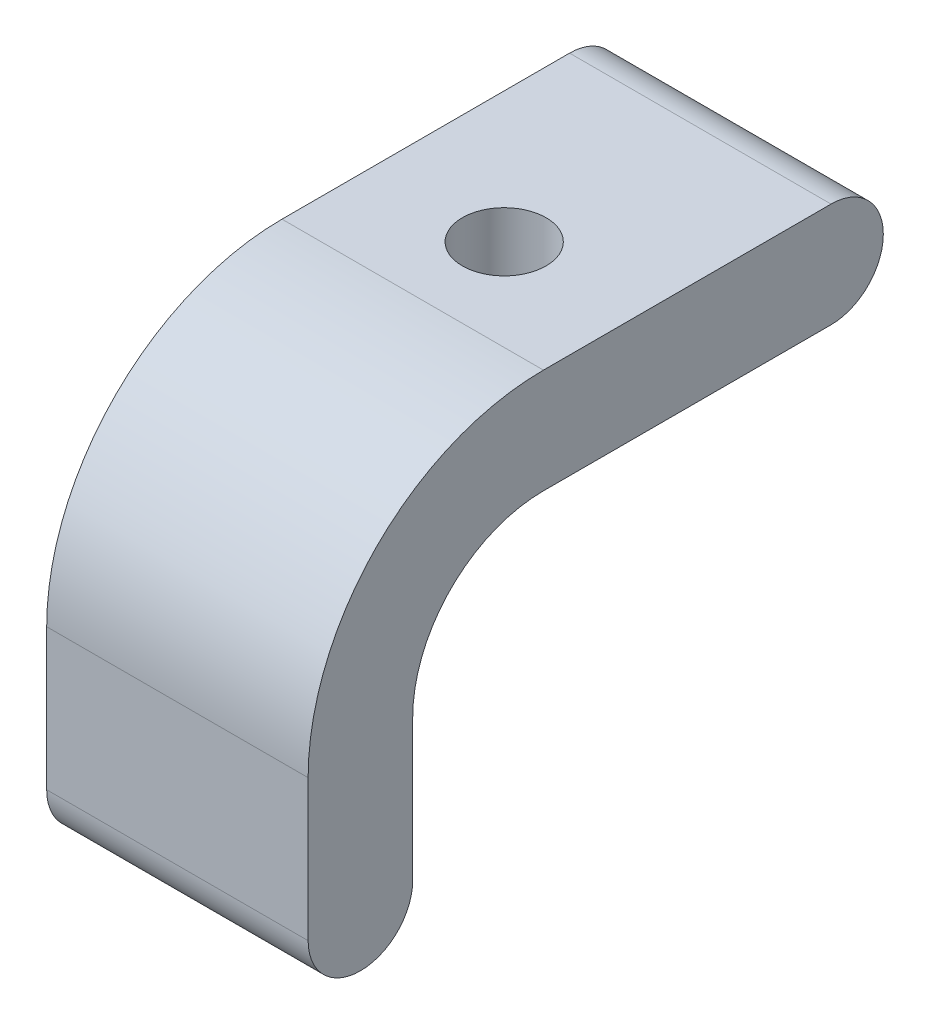
ISO-10303-21;
HEADER;
FILE_DESCRIPTION(('STEP AP214'),'2;1');
FILE_NAME('part.step','',(''),(''),'','','');
FILE_SCHEMA(('AUTOMOTIVE_DESIGN { 1 0 10303 214 1 1 1 1 }'));
ENDSEC;
DATA;
#1=APPLICATION_CONTEXT('core data for automotive mechanical design processes');
#2=APPLICATION_PROTOCOL_DEFINITION('international standard','automotive_design',2000,#1);
#3=PRODUCT_CONTEXT('',#1,'mechanical');
#4=PRODUCT('Part','Part','',(#3));
#5=PRODUCT_RELATED_PRODUCT_CATEGORY('part','',(#4));
#6=PRODUCT_DEFINITION_FORMATION('','',#4);
#7=PRODUCT_DEFINITION_CONTEXT('part definition',#1,'design');
#8=PRODUCT_DEFINITION('design','',#6,#7);
#9=PRODUCT_DEFINITION_SHAPE('','',#8);
#10=(LENGTH_UNIT() NAMED_UNIT(*) SI_UNIT(.MILLI.,.METRE.));
#11=(NAMED_UNIT(*) PLANE_ANGLE_UNIT() SI_UNIT($,.RADIAN.));
#12=(NAMED_UNIT(*) SI_UNIT($,.STERADIAN.) SOLID_ANGLE_UNIT());
#13=UNCERTAINTY_MEASURE_WITH_UNIT(LENGTH_MEASURE(1.E-05),#10,'distance_accuracy_value','');
#14=(GEOMETRIC_REPRESENTATION_CONTEXT(3) GLOBAL_UNCERTAINTY_ASSIGNED_CONTEXT((#13)) GLOBAL_UNIT_ASSIGNED_CONTEXT((#10,
#11,#12)) REPRESENTATION_CONTEXT('',''));
#15=CARTESIAN_POINT('',(0.,0.,0.));
#16=DIRECTION('',(0.,0.,1.));
#17=DIRECTION('',(1.,0.,0.));
#18=AXIS2_PLACEMENT_3D('',#15,#16,#17);
#19=CARTESIAN_POINT('',(10.,-4.99999999999999,0.));
#20=DIRECTION('',(-1.,0.,0.));
#21=DIRECTION('',(0.,0.,1.));
#22=AXIS2_PLACEMENT_3D('',#19,#20,#21);
#23=CYLINDRICAL_SURFACE('',#22,5.);
#24=CARTESIAN_POINT('',(0.,-4.99999999999999,0.));
#25=DIRECTION('',(-1.,0.,0.));
#26=DIRECTION('',(0.,0.,-1.));
#27=AXIS2_PLACEMENT_3D('',#24,#25,#26);
#28=CIRCLE('',#27,5.);
#29=CARTESIAN_POINT('',(0.,-4.99999999999999,5.));
#30=VERTEX_POINT('',#29);
#31=CARTESIAN_POINT('',(0.,0.,0.));
#32=VERTEX_POINT('',#31);
#33=EDGE_CURVE('E132',#30,#32,#28,.T.);
#34=ORIENTED_EDGE('',*,*,#33,.T.);
#35=DIRECTION('',(-1.,0.,0.));
#36=VECTOR('',#35,1.);
#37=CARTESIAN_POINT('',(10.,0.,0.));
#38=LINE('',#37,#36);
#39=CARTESIAN_POINT('',(10.,0.,0.));
#40=VERTEX_POINT('',#39);
#41=EDGE_CURVE('E11',#40,#32,#38,.T.);
#42=ORIENTED_EDGE('',*,*,#41,.F.);
#43=CARTESIAN_POINT('',(10.,-4.99999999999999,0.));
#44=DIRECTION('',(-1.,0.,0.));
#45=DIRECTION('',(0.,0.,-1.));
#46=AXIS2_PLACEMENT_3D('',#43,#44,#45);
#47=CIRCLE('',#46,5.);
#48=CARTESIAN_POINT('',(10.,-4.99999999999999,5.));
#49=VERTEX_POINT('',#48);
#50=EDGE_CURVE('E147',#49,#40,#47,.T.);
#51=ORIENTED_EDGE('',*,*,#50,.F.);
#52=DIRECTION('',(-1.,0.,0.));
#53=VECTOR('',#52,1.);
#54=CARTESIAN_POINT('',(10.,-4.99999999999999,5.));
#55=LINE('',#54,#53);
#56=EDGE_CURVE('E128',#49,#30,#55,.T.);
#57=ORIENTED_EDGE('',*,*,#56,.T.);
#58=EDGE_LOOP('',(#34,#42,#51,#57));
#59=FACE_BOUND('',#58,.T.);
#60=ADVANCED_FACE('F36',(#59),#23,.F.);
#61=CARTESIAN_POINT('',(10.,0.,0.));
#62=DIRECTION('',(0.,1.,0.));
#63=DIRECTION('',(0.,0.,1.));
#64=AXIS2_PLACEMENT_3D('',#61,#62,#63);
#65=PLANE('',#64);
#66=CARTESIAN_POINT('',(5.,0.,-3.5));
#67=DIRECTION('',(0.,1.,0.));
#68=DIRECTION('',(0.,0.,1.));
#69=AXIS2_PLACEMENT_3D('',#66,#67,#68);
#70=CIRCLE('',#69,1.6);
#71=CARTESIAN_POINT('',(5.,0.,-1.9));
#72=VERTEX_POINT('',#71);
#73=EDGE_CURVE('E136',#72,#72,#70,.T.);
#74=ORIENTED_EDGE('',*,*,#73,.T.);
#75=EDGE_LOOP('',(#74));
#76=FACE_BOUND('',#75,.T.);
#77=DIRECTION('',(0.,0.,-1.));
#78=VECTOR('',#77,1.);
#79=CARTESIAN_POINT('',(0.,0.,0.));
#80=LINE('',#79,#78);
#81=CARTESIAN_POINT('',(0.,0.,-11.));
#82=VERTEX_POINT('',#81);
#83=EDGE_CURVE('E135',#32,#82,#80,.T.);
#84=ORIENTED_EDGE('',*,*,#83,.T.);
#85=DIRECTION('',(-1.,0.,0.));
#86=VECTOR('',#85,1.);
#87=CARTESIAN_POINT('',(10.,0.,-11.));
#88=LINE('',#87,#86);
#89=CARTESIAN_POINT('',(10.,0.,-11.));
#90=VERTEX_POINT('',#89);
#91=EDGE_CURVE('E44',#90,#82,#88,.T.);
#92=ORIENTED_EDGE('',*,*,#91,.F.);
#93=DIRECTION('',(0.,0.,-1.));
#94=VECTOR('',#93,1.);
#95=CARTESIAN_POINT('',(10.,0.,0.));
#96=LINE('',#95,#94);
#97=EDGE_CURVE('E95',#40,#90,#96,.T.);
#98=ORIENTED_EDGE('',*,*,#97,.F.);
#99=ORIENTED_EDGE('',*,*,#41,.T.);
#100=EDGE_LOOP('',(#84,#92,#98,#99));
#101=FACE_BOUND('',#100,.T.);
#102=ADVANCED_FACE('F196',(#76,#101),#65,.F.);
#103=CARTESIAN_POINT('',(10.,2.,-11.));
#104=DIRECTION('',(-1.,0.,0.));
#105=DIRECTION('',(0.,0.,1.));
#106=AXIS2_PLACEMENT_3D('',#103,#104,#105);
#107=CYLINDRICAL_SURFACE('',#106,2.);
#108=CARTESIAN_POINT('',(0.,2.,-11.));
#109=DIRECTION('',(1.,0.,0.));
#110=DIRECTION('',(0.,0.,1.));
#111=AXIS2_PLACEMENT_3D('',#108,#109,#110);
#112=CIRCLE('',#111,2.);
#113=CARTESIAN_POINT('',(0.,4.,-11.));
#114=VERTEX_POINT('',#113);
#115=EDGE_CURVE('E138',#82,#114,#112,.T.);
#116=ORIENTED_EDGE('',*,*,#115,.T.);
#117=DIRECTION('',(-1.,0.,0.));
#118=VECTOR('',#117,1.);
#119=CARTESIAN_POINT('',(10.,4.,-11.));
#120=LINE('',#119,#118);
#121=CARTESIAN_POINT('',(10.,4.,-11.));
#122=VERTEX_POINT('',#121);
#123=EDGE_CURVE('E154',#122,#114,#120,.T.);
#124=ORIENTED_EDGE('',*,*,#123,.F.);
#125=CARTESIAN_POINT('',(10.,2.,-11.));
#126=DIRECTION('',(1.,0.,0.));
#127=DIRECTION('',(0.,0.,1.));
#128=AXIS2_PLACEMENT_3D('',#125,#126,#127);
#129=CIRCLE('',#128,2.);
#130=EDGE_CURVE('E162',#90,#122,#129,.T.);
#131=ORIENTED_EDGE('',*,*,#130,.F.);
#132=ORIENTED_EDGE('',*,*,#91,.T.);
#133=EDGE_LOOP('',(#116,#124,#131,#132));
#134=FACE_BOUND('',#133,.T.);
#135=ADVANCED_FACE('F160',(#134),#107,.T.);
#136=CARTESIAN_POINT('',(10.,4.,-11.));
#137=DIRECTION('',(0.,-1.,0.));
#138=DIRECTION('',(0.,0.,-1.));
#139=AXIS2_PLACEMENT_3D('',#136,#137,#138);
#140=PLANE('',#139);
#141=CARTESIAN_POINT('',(5.,4.,-3.5));
#142=DIRECTION('',(0.,1.,0.));
#143=DIRECTION('',(0.,0.,1.));
#144=AXIS2_PLACEMENT_3D('',#141,#142,#143);
#145=CIRCLE('',#144,1.6);
#146=CARTESIAN_POINT('',(5.,4.,-1.9));
#147=VERTEX_POINT('',#146);
#148=EDGE_CURVE('E182',#147,#147,#145,.T.);
#149=ORIENTED_EDGE('',*,*,#148,.F.);
#150=EDGE_LOOP('',(#149));
#151=FACE_BOUND('',#150,.T.);
#152=DIRECTION('',(0.,0.,1.));
#153=VECTOR('',#152,1.);
#154=CARTESIAN_POINT('',(0.,4.,-11.));
#155=LINE('',#154,#153);
#156=CARTESIAN_POINT('',(0.,4.,0.));
#157=VERTEX_POINT('',#156);
#158=EDGE_CURVE('E140',#114,#157,#155,.T.);
#159=ORIENTED_EDGE('',*,*,#158,.T.);
#160=DIRECTION('',(-1.,0.,0.));
#161=VECTOR('',#160,1.);
#162=CARTESIAN_POINT('',(10.,4.,0.));
#163=LINE('',#162,#161);
#164=CARTESIAN_POINT('',(10.,4.,0.));
#165=VERTEX_POINT('',#164);
#166=EDGE_CURVE('E151',#165,#157,#163,.T.);
#167=ORIENTED_EDGE('',*,*,#166,.F.);
#168=DIRECTION('',(0.,0.,1.));
#169=VECTOR('',#168,1.);
#170=CARTESIAN_POINT('',(10.,4.,-11.));
#171=LINE('',#170,#169);
#172=EDGE_CURVE('E174',#122,#165,#171,.T.);
#173=ORIENTED_EDGE('',*,*,#172,.F.);
#174=ORIENTED_EDGE('',*,*,#123,.T.);
#175=EDGE_LOOP('',(#159,#167,#173,#174));
#176=FACE_BOUND('',#175,.T.);
#177=ADVANCED_FACE('F170',(#151,#176),#140,.F.);
#178=CARTESIAN_POINT('',(10.,-4.99999999999998,0.));
#179=DIRECTION('',(-1.,0.,0.));
#180=DIRECTION('',(0.,0.,1.));
#181=AXIS2_PLACEMENT_3D('',#178,#179,#180);
#182=CYLINDRICAL_SURFACE('',#181,8.99999999999999);
#183=CARTESIAN_POINT('',(0.,-4.99999999999998,0.));
#184=DIRECTION('',(1.,0.,0.));
#185=DIRECTION('',(0.,0.,1.));
#186=AXIS2_PLACEMENT_3D('',#183,#184,#185);
#187=CIRCLE('',#186,8.99999999999999);
#188=CARTESIAN_POINT('',(0.,-4.99999999999998,9.00000000000001));
#189=VERTEX_POINT('',#188);
#190=EDGE_CURVE('E142',#157,#189,#187,.T.);
#191=ORIENTED_EDGE('',*,*,#190,.T.);
#192=DIRECTION('',(-1.,0.,0.));
#193=VECTOR('',#192,1.);
#194=CARTESIAN_POINT('',(10.,-4.99999999999998,9.00000000000001));
#195=LINE('',#194,#193);
#196=CARTESIAN_POINT('',(10.,-4.99999999999998,9.00000000000001));
#197=VERTEX_POINT('',#196);
#198=EDGE_CURVE('E123',#197,#189,#195,.T.);
#199=ORIENTED_EDGE('',*,*,#198,.F.);
#200=CARTESIAN_POINT('',(10.,-4.99999999999998,0.));
#201=DIRECTION('',(1.,0.,0.));
#202=DIRECTION('',(0.,0.,1.));
#203=AXIS2_PLACEMENT_3D('',#200,#201,#202);
#204=CIRCLE('',#203,8.99999999999999);
#205=EDGE_CURVE('E114',#165,#197,#204,.T.);
#206=ORIENTED_EDGE('',*,*,#205,.F.);
#207=ORIENTED_EDGE('',*,*,#166,.T.);
#208=EDGE_LOOP('',(#191,#199,#206,#207));
#209=FACE_BOUND('',#208,.T.);
#210=ADVANCED_FACE('F173',(#209),#182,.T.);
#211=CARTESIAN_POINT('',(10.,-4.99999999999998,9.00000000000001));
#212=DIRECTION('',(0.,0.,-1.));
#213=DIRECTION('',(0.,1.,0.));
#214=AXIS2_PLACEMENT_3D('',#211,#212,#213);
#215=PLANE('',#214);
#216=DIRECTION('',(0.,-1.,0.));
#217=VECTOR('',#216,1.);
#218=CARTESIAN_POINT('',(0.,-4.99999999999998,9.00000000000001));
#219=LINE('',#218,#217);
#220=CARTESIAN_POINT('',(0.,-10.4,9.00000000000001));
#221=VERTEX_POINT('',#220);
#222=EDGE_CURVE('E122',#189,#221,#219,.T.);
#223=ORIENTED_EDGE('',*,*,#222,.T.);
#224=DIRECTION('',(-1.,0.,0.));
#225=VECTOR('',#224,1.);
#226=CARTESIAN_POINT('',(10.,-10.4,9.00000000000001));
#227=LINE('',#226,#225);
#228=CARTESIAN_POINT('',(10.,-10.4,9.00000000000001));
#229=VERTEX_POINT('',#228);
#230=EDGE_CURVE('E119',#229,#221,#227,.T.);
#231=ORIENTED_EDGE('',*,*,#230,.F.);
#232=DIRECTION('',(0.,-1.,0.));
#233=VECTOR('',#232,1.);
#234=CARTESIAN_POINT('',(10.,-4.99999999999998,9.00000000000001));
#235=LINE('',#234,#233);
#236=EDGE_CURVE('E108',#197,#229,#235,.T.);
#237=ORIENTED_EDGE('',*,*,#236,.F.);
#238=ORIENTED_EDGE('',*,*,#198,.T.);
#239=EDGE_LOOP('',(#223,#231,#237,#238));
#240=FACE_BOUND('',#239,.T.);
#241=ADVANCED_FACE('F120',(#240),#215,.F.);
#242=CARTESIAN_POINT('',(10.,-10.4,7.00000000000001));
#243=DIRECTION('',(-1.,0.,0.));
#244=DIRECTION('',(0.,0.,1.));
#245=AXIS2_PLACEMENT_3D('',#242,#243,#244);
#246=CYLINDRICAL_SURFACE('',#245,2.);
#247=CARTESIAN_POINT('',(0.,-10.4,7.00000000000001));
#248=DIRECTION('',(1.,0.,0.));
#249=DIRECTION('',(0.,0.,1.));
#250=AXIS2_PLACEMENT_3D('',#247,#248,#249);
#251=CIRCLE('',#250,2.);
#252=CARTESIAN_POINT('',(0.,-10.4,5.00000000000001));
#253=VERTEX_POINT('',#252);
#254=EDGE_CURVE('E81',#221,#253,#251,.T.);
#255=ORIENTED_EDGE('',*,*,#254,.T.);
#256=DIRECTION('',(-1.,0.,0.));
#257=VECTOR('',#256,1.);
#258=CARTESIAN_POINT('',(10.,-10.4,5.00000000000001));
#259=LINE('',#258,#257);
#260=CARTESIAN_POINT('',(10.,-10.4,5.00000000000001));
#261=VERTEX_POINT('',#260);
#262=EDGE_CURVE('E124',#261,#253,#259,.T.);
#263=ORIENTED_EDGE('',*,*,#262,.F.);
#264=CARTESIAN_POINT('',(10.,-10.4,7.00000000000001));
#265=DIRECTION('',(1.,0.,0.));
#266=DIRECTION('',(0.,0.,1.));
#267=AXIS2_PLACEMENT_3D('',#264,#265,#266);
#268=CIRCLE('',#267,2.);
#269=EDGE_CURVE('E112',#229,#261,#268,.T.);
#270=ORIENTED_EDGE('',*,*,#269,.F.);
#271=ORIENTED_EDGE('',*,*,#230,.T.);
#272=EDGE_LOOP('',(#255,#263,#270,#271));
#273=FACE_BOUND('',#272,.T.);
#274=ADVANCED_FACE('F126',(#273),#246,.T.);
#275=CARTESIAN_POINT('',(10.,-4.99999999999999,5.));
#276=DIRECTION('',(0.,0.,1.));
#277=DIRECTION('',(0.,-1.,0.));
#278=AXIS2_PLACEMENT_3D('',#275,#276,#277);
#279=PLANE('',#278);
#280=DIRECTION('',(0.,1.,0.));
#281=VECTOR('',#280,1.);
#282=CARTESIAN_POINT('',(0.,-4.99999999999999,5.));
#283=LINE('',#282,#281);
#284=EDGE_CURVE('E87',#253,#30,#283,.T.);
#285=ORIENTED_EDGE('',*,*,#284,.T.);
#286=ORIENTED_EDGE('',*,*,#56,.F.);
#287=DIRECTION('',(0.,1.,0.));
#288=VECTOR('',#287,1.);
#289=CARTESIAN_POINT('',(10.,-4.99999999999999,5.));
#290=LINE('',#289,#288);
#291=EDGE_CURVE('E52',#261,#49,#290,.T.);
#292=ORIENTED_EDGE('',*,*,#291,.F.);
#293=ORIENTED_EDGE('',*,*,#262,.T.);
#294=EDGE_LOOP('',(#285,#286,#292,#293));
#295=FACE_BOUND('',#294,.T.);
#296=ADVANCED_FACE('F206',(#295),#279,.F.);
#297=CARTESIAN_POINT('',(10.,-4.99999999999999,0.));
#298=DIRECTION('',(1.,0.,0.));
#299=DIRECTION('',(0.,0.,-1.));
#300=AXIS2_PLACEMENT_3D('',#297,#298,#299);
#301=PLANE('',#300);
#302=ORIENTED_EDGE('',*,*,#50,.T.);
#303=ORIENTED_EDGE('',*,*,#97,.T.);
#304=ORIENTED_EDGE('',*,*,#130,.T.);
#305=ORIENTED_EDGE('',*,*,#172,.T.);
#306=ORIENTED_EDGE('',*,*,#205,.T.);
#307=ORIENTED_EDGE('',*,*,#236,.T.);
#308=ORIENTED_EDGE('',*,*,#269,.T.);
#309=ORIENTED_EDGE('',*,*,#291,.T.);
#310=EDGE_LOOP('',(#302,#303,#304,#305,#306,#307,#308,#309));
#311=FACE_BOUND('',#310,.T.);
#312=ADVANCED_FACE('F110',(#311),#301,.T.);
#313=CARTESIAN_POINT('',(0.,-4.99999999999999,0.));
#314=DIRECTION('',(1.,0.,0.));
#315=DIRECTION('',(0.,0.,-1.));
#316=AXIS2_PLACEMENT_3D('',#313,#314,#315);
#317=PLANE('',#316);
#318=ORIENTED_EDGE('',*,*,#33,.F.);
#319=ORIENTED_EDGE('',*,*,#284,.F.);
#320=ORIENTED_EDGE('',*,*,#254,.F.);
#321=ORIENTED_EDGE('',*,*,#222,.F.);
#322=ORIENTED_EDGE('',*,*,#190,.F.);
#323=ORIENTED_EDGE('',*,*,#158,.F.);
#324=ORIENTED_EDGE('',*,*,#115,.F.);
#325=ORIENTED_EDGE('',*,*,#83,.F.);
#326=EDGE_LOOP('',(#318,#319,#320,#321,#322,#323,#324,#325));
#327=FACE_BOUND('',#326,.T.);
#328=ADVANCED_FACE('F166',(#327),#317,.F.);
#329=CARTESIAN_POINT('',(5.,-6.,-3.5));
#330=DIRECTION('',(0.,1.,0.));
#331=DIRECTION('',(0.,0.,1.));
#332=AXIS2_PLACEMENT_3D('',#329,#330,#331);
#333=CYLINDRICAL_SURFACE('',#332,1.6);
#334=ORIENTED_EDGE('',*,*,#148,.T.);
#335=EDGE_LOOP('',(#334));
#336=FACE_BOUND('',#335,.T.);
#337=ORIENTED_EDGE('',*,*,#73,.F.);
#338=EDGE_LOOP('',(#337));
#339=FACE_BOUND('',#338,.T.);
#340=ADVANCED_FACE('F186',(#336,#339),#333,.F.);
#341=CLOSED_SHELL('',(#60,#102,#135,#177,#210,#241,#274,#296,#312,#328,#340));
#342=MANIFOLD_SOLID_BREP('B2',#341);
#343=ADVANCED_BREP_SHAPE_REPRESENTATION('',(#18,#342),#14);
#344=SHAPE_DEFINITION_REPRESENTATION(#9,#343);
ENDSEC;
END-ISO-10303-21;
